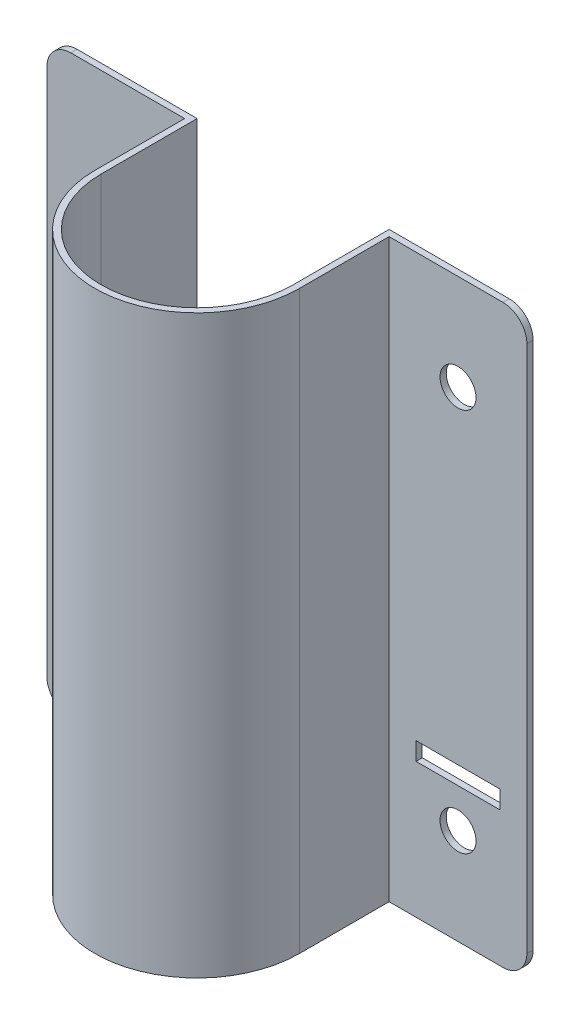
ISO-10303-21;
HEADER;
FILE_DESCRIPTION(('STEP AP214'),'2;1');
FILE_NAME('part.step','',(''),(''),'','','');
FILE_SCHEMA(('AUTOMOTIVE_DESIGN { 1 0 10303 214 1 1 1 1 }'));
ENDSEC;
DATA;
#1=APPLICATION_CONTEXT('core data for automotive mechanical design processes');
#2=APPLICATION_PROTOCOL_DEFINITION('international standard','automotive_design',2000,#1);
#3=PRODUCT_CONTEXT('',#1,'mechanical');
#4=PRODUCT('Part','Part','',(#3));
#5=PRODUCT_RELATED_PRODUCT_CATEGORY('part','',(#4));
#6=PRODUCT_DEFINITION_FORMATION('','',#4);
#7=PRODUCT_DEFINITION_CONTEXT('part definition',#1,'design');
#8=PRODUCT_DEFINITION('design','',#6,#7);
#9=PRODUCT_DEFINITION_SHAPE('','',#8);
#10=(LENGTH_UNIT() NAMED_UNIT(*) SI_UNIT(.MILLI.,.METRE.));
#11=(NAMED_UNIT(*) PLANE_ANGLE_UNIT() SI_UNIT($,.RADIAN.));
#12=(NAMED_UNIT(*) SI_UNIT($,.STERADIAN.) SOLID_ANGLE_UNIT());
#13=UNCERTAINTY_MEASURE_WITH_UNIT(LENGTH_MEASURE(1.E-05),#10,'distance_accuracy_value','');
#14=(GEOMETRIC_REPRESENTATION_CONTEXT(3) GLOBAL_UNCERTAINTY_ASSIGNED_CONTEXT((#13)) GLOBAL_UNIT_ASSIGNED_CONTEXT((#10,
#11,#12)) REPRESENTATION_CONTEXT('',''));
#15=CARTESIAN_POINT('',(0.,0.,0.));
#16=DIRECTION('',(0.,0.,1.));
#17=DIRECTION('',(1.,0.,0.));
#18=AXIS2_PLACEMENT_3D('',#15,#16,#17);
#19=CARTESIAN_POINT('',(0.,-152.4,0.));
#20=DIRECTION('',(0.,1.,0.));
#21=DIRECTION('',(0.,0.,1.));
#22=AXIS2_PLACEMENT_3D('',#19,#20,#21);
#23=CYLINDRICAL_SURFACE('',#22,25.4);
#24=CARTESIAN_POINT('',(0.,0.,0.));
#25=DIRECTION('',(0.,-1.,0.));
#26=DIRECTION('',(0.,0.,1.));
#27=AXIS2_PLACEMENT_3D('',#24,#25,#26);
#28=CIRCLE('',#27,25.4);
#29=CARTESIAN_POINT('',(25.4,0.,0.));
#30=VERTEX_POINT('',#29);
#31=CARTESIAN_POINT('',(-25.4,0.,0.));
#32=VERTEX_POINT('',#31);
#33=EDGE_CURVE('E284',#30,#32,#28,.T.);
#34=ORIENTED_EDGE('',*,*,#33,.F.);
#35=DIRECTION('',(0.,1.,0.));
#36=VECTOR('',#35,1.);
#37=CARTESIAN_POINT('',(25.4,-152.4,0.));
#38=LINE('',#37,#36);
#39=CARTESIAN_POINT('',(25.4,-152.4,0.));
#40=VERTEX_POINT('',#39);
#41=EDGE_CURVE('E341',#40,#30,#38,.T.);
#42=ORIENTED_EDGE('',*,*,#41,.F.);
#43=CARTESIAN_POINT('',(0.,-152.4,0.));
#44=DIRECTION('',(0.,-1.,0.));
#45=DIRECTION('',(0.,0.,1.));
#46=AXIS2_PLACEMENT_3D('',#43,#44,#45);
#47=CIRCLE('',#46,25.4);
#48=CARTESIAN_POINT('',(-25.4,-152.4,0.));
#49=VERTEX_POINT('',#48);
#50=EDGE_CURVE('E285',#40,#49,#47,.T.);
#51=ORIENTED_EDGE('',*,*,#50,.T.);
#52=DIRECTION('',(0.,1.,0.));
#53=VECTOR('',#52,1.);
#54=CARTESIAN_POINT('',(-25.4,-152.4,0.));
#55=LINE('',#54,#53);
#56=EDGE_CURVE('E314',#49,#32,#55,.T.);
#57=ORIENTED_EDGE('',*,*,#56,.T.);
#58=EDGE_LOOP('',(#34,#42,#51,#57));
#59=FACE_BOUND('',#58,.T.);
#60=ADVANCED_FACE('F36',(#59),#23,.F.);
#61=CARTESIAN_POINT('',(25.4,-152.4,0.));
#62=DIRECTION('',(-1.,0.,0.));
#63=DIRECTION('',(0.,0.,1.));
#64=AXIS2_PLACEMENT_3D('',#61,#62,#63);
#65=PLANE('',#64);
#66=DIRECTION('',(0.,0.,1.));
#67=VECTOR('',#66,1.);
#68=CARTESIAN_POINT('',(25.4,0.,0.));
#69=LINE('',#68,#67);
#70=CARTESIAN_POINT('',(25.4,0.,-25.4));
#71=VERTEX_POINT('',#70);
#72=EDGE_CURVE('E289',#71,#30,#69,.T.);
#73=ORIENTED_EDGE('',*,*,#72,.F.);
#74=DIRECTION('',(0.,1.,0.));
#75=VECTOR('',#74,1.);
#76=CARTESIAN_POINT('',(25.4,-152.4,-25.4));
#77=LINE('',#76,#75);
#78=CARTESIAN_POINT('',(25.4,-152.4,-25.4));
#79=VERTEX_POINT('',#78);
#80=EDGE_CURVE('E344',#79,#71,#77,.T.);
#81=ORIENTED_EDGE('',*,*,#80,.F.);
#82=DIRECTION('',(0.,0.,1.));
#83=VECTOR('',#82,1.);
#84=CARTESIAN_POINT('',(25.4,-152.4,0.));
#85=LINE('',#84,#83);
#86=EDGE_CURVE('E311',#79,#40,#85,.T.);
#87=ORIENTED_EDGE('',*,*,#86,.T.);
#88=ORIENTED_EDGE('',*,*,#41,.T.);
#89=EDGE_LOOP('',(#73,#81,#87,#88));
#90=FACE_BOUND('',#89,.T.);
#91=ADVANCED_FACE('F449',(#90),#65,.T.);
#92=CARTESIAN_POINT('',(25.4,-152.4,-25.4));
#93=DIRECTION('',(0.,0.,-1.));
#94=DIRECTION('',(-1.,0.,0.));
#95=AXIS2_PLACEMENT_3D('',#92,#93,#94);
#96=PLANE('',#95);
#97=DIRECTION('',(0.,-1.,0.));
#98=VECTOR('',#97,1.);
#99=CARTESIAN_POINT('',(34.163,-116.68125,-25.4));
#100=LINE('',#99,#98);
#101=CARTESIAN_POINT('',(34.163,-111.91875,-25.4));
#102=VERTEX_POINT('',#101);
#103=CARTESIAN_POINT('',(34.163,-116.68125,-25.4));
#104=VERTEX_POINT('',#103);
#105=EDGE_CURVE('E198',#102,#104,#100,.T.);
#106=ORIENTED_EDGE('',*,*,#105,.T.);
#107=DIRECTION('',(1.,0.,0.));
#108=VECTOR('',#107,1.);
#109=CARTESIAN_POINT('',(56.388,-116.68125,-25.4));
#110=LINE('',#109,#108);
#111=CARTESIAN_POINT('',(56.388,-116.68125,-25.4));
#112=VERTEX_POINT('',#111);
#113=EDGE_CURVE('E207',#104,#112,#110,.T.);
#114=ORIENTED_EDGE('',*,*,#113,.T.);
#115=DIRECTION('',(0.,1.,0.));
#116=VECTOR('',#115,1.);
#117=CARTESIAN_POINT('',(56.388,-116.68125,-25.4));
#118=LINE('',#117,#116);
#119=CARTESIAN_POINT('',(56.388,-111.91875,-25.4));
#120=VERTEX_POINT('',#119);
#121=EDGE_CURVE('E51',#112,#120,#118,.T.);
#122=ORIENTED_EDGE('',*,*,#121,.T.);
#123=DIRECTION('',(-1.,0.,0.));
#124=VECTOR('',#123,1.);
#125=CARTESIAN_POINT('',(56.388,-111.91875,-25.4));
#126=LINE('',#125,#124);
#127=EDGE_CURVE('E204',#120,#102,#126,.T.);
#128=ORIENTED_EDGE('',*,*,#127,.T.);
#129=EDGE_LOOP('',(#106,#114,#122,#128));
#130=FACE_BOUND('',#129,.T.);
#131=CARTESIAN_POINT('',(45.2755,-25.4,-25.4));
#132=DIRECTION('',(0.,0.,-1.));
#133=DIRECTION('',(-1.,0.,0.));
#134=AXIS2_PLACEMENT_3D('',#131,#132,#133);
#135=CIRCLE('',#134,4.76249999999999);
#136=CARTESIAN_POINT('',(40.513,-25.4,-25.4));
#137=VERTEX_POINT('',#136);
#138=EDGE_CURVE('E280',#137,#137,#135,.T.);
#139=ORIENTED_EDGE('',*,*,#138,.F.);
#140=EDGE_LOOP('',(#139));
#141=FACE_BOUND('',#140,.T.);
#142=CARTESIAN_POINT('',(45.2755,-127.,-25.4));
#143=DIRECTION('',(0.,0.,-1.));
#144=DIRECTION('',(-1.,0.,0.));
#145=AXIS2_PLACEMENT_3D('',#142,#143,#144);
#146=CIRCLE('',#145,4.76250000000002);
#147=CARTESIAN_POINT('',(40.513,-127.,-25.4));
#148=VERTEX_POINT('',#147);
#149=EDGE_CURVE('E277',#148,#148,#146,.T.);
#150=ORIENTED_EDGE('',*,*,#149,.F.);
#151=EDGE_LOOP('',(#150));
#152=FACE_BOUND('',#151,.T.);
#153=DIRECTION('',(-1.,0.,0.));
#154=VECTOR('',#153,1.);
#155=CARTESIAN_POINT('',(25.4,0.,-25.4));
#156=LINE('',#155,#154);
#157=CARTESIAN_POINT('',(57.15,0.,-25.4));
#158=VERTEX_POINT('',#157);
#159=EDGE_CURVE('E337',#158,#71,#156,.T.);
#160=ORIENTED_EDGE('',*,*,#159,.F.);
#161=CARTESIAN_POINT('',(57.15,-6.35,-25.4));
#162=DIRECTION('',(0.,0.,-1.));
#163=DIRECTION('',(-1.,0.,0.));
#164=AXIS2_PLACEMENT_3D('',#161,#162,#163);
#165=CIRCLE('',#164,6.35);
#166=CARTESIAN_POINT('',(63.5,-6.35000000000005,-25.4));
#167=VERTEX_POINT('',#166);
#168=EDGE_CURVE('E382',#158,#167,#165,.T.);
#169=ORIENTED_EDGE('',*,*,#168,.T.);
#170=DIRECTION('',(0.,1.,0.));
#171=VECTOR('',#170,1.);
#172=CARTESIAN_POINT('',(63.5,-152.4,-25.4));
#173=LINE('',#172,#171);
#174=CARTESIAN_POINT('',(63.5,-146.05,-25.4));
#175=VERTEX_POINT('',#174);
#176=EDGE_CURVE('E347',#175,#167,#173,.T.);
#177=ORIENTED_EDGE('',*,*,#176,.F.);
#178=CARTESIAN_POINT('',(57.15,-146.05,-25.4));
#179=DIRECTION('',(0.,0.,-1.));
#180=DIRECTION('',(-1.,0.,0.));
#181=AXIS2_PLACEMENT_3D('',#178,#179,#180);
#182=CIRCLE('',#181,6.35);
#183=CARTESIAN_POINT('',(57.15,-152.4,-25.4));
#184=VERTEX_POINT('',#183);
#185=EDGE_CURVE('E380',#175,#184,#182,.T.);
#186=ORIENTED_EDGE('',*,*,#185,.T.);
#187=DIRECTION('',(-1.,0.,0.));
#188=VECTOR('',#187,1.);
#189=CARTESIAN_POINT('',(25.4,-152.4,-25.4));
#190=LINE('',#189,#188);
#191=EDGE_CURVE('E309',#184,#79,#190,.T.);
#192=ORIENTED_EDGE('',*,*,#191,.T.);
#193=ORIENTED_EDGE('',*,*,#80,.T.);
#194=EDGE_LOOP('',(#160,#169,#177,#186,#192,#193));
#195=FACE_BOUND('',#194,.T.);
#196=ADVANCED_FACE('F211',(#130,#141,#152,#195),#96,.T.);
#197=CARTESIAN_POINT('',(63.5,-152.4,-25.4));
#198=DIRECTION('',(1.,0.,0.));
#199=DIRECTION('',(0.,0.,-1.));
#200=AXIS2_PLACEMENT_3D('',#197,#198,#199);
#201=PLANE('',#200);
#202=ORIENTED_EDGE('',*,*,#176,.T.);
#203=DIRECTION('',(0.,0.,-1.));
#204=VECTOR('',#203,1.);
#205=CARTESIAN_POINT('',(63.5,-6.34999999999999,-25.4));
#206=LINE('',#205,#204);
#207=CARTESIAN_POINT('',(63.5,-6.35000000000005,-23.749));
#208=VERTEX_POINT('',#207);
#209=EDGE_CURVE('E387',#167,#208,#206,.F.);
#210=ORIENTED_EDGE('',*,*,#209,.T.);
#211=DIRECTION('',(0.,1.,0.));
#212=VECTOR('',#211,1.);
#213=CARTESIAN_POINT('',(63.5,-152.4,-23.749));
#214=LINE('',#213,#212);
#215=CARTESIAN_POINT('',(63.5,-146.05,-23.749));
#216=VERTEX_POINT('',#215);
#217=EDGE_CURVE('E350',#216,#208,#214,.T.);
#218=ORIENTED_EDGE('',*,*,#217,.F.);
#219=DIRECTION('',(0.,0.,-1.));
#220=VECTOR('',#219,1.);
#221=CARTESIAN_POINT('',(63.5,-146.05,-25.4));
#222=LINE('',#221,#220);
#223=EDGE_CURVE('E384',#216,#175,#222,.T.);
#224=ORIENTED_EDGE('',*,*,#223,.T.);
#225=EDGE_LOOP('',(#202,#210,#218,#224));
#226=FACE_BOUND('',#225,.T.);
#227=ADVANCED_FACE('F463',(#226),#201,.T.);
#228=CARTESIAN_POINT('',(27.051,-152.4,-23.749));
#229=DIRECTION('',(0.,0.,1.));
#230=DIRECTION('',(1.,0.,0.));
#231=AXIS2_PLACEMENT_3D('',#228,#229,#230);
#232=PLANE('',#231);
#233=DIRECTION('',(0.,-1.,0.));
#234=VECTOR('',#233,1.);
#235=CARTESIAN_POINT('',(34.163,-116.68125,-23.749));
#236=LINE('',#235,#234);
#237=CARTESIAN_POINT('',(34.163,-111.91875,-23.749));
#238=VERTEX_POINT('',#237);
#239=CARTESIAN_POINT('',(34.163,-116.68125,-23.749));
#240=VERTEX_POINT('',#239);
#241=EDGE_CURVE('E59',#238,#240,#236,.T.);
#242=ORIENTED_EDGE('',*,*,#241,.F.);
#243=DIRECTION('',(-1.,0.,0.));
#244=VECTOR('',#243,1.);
#245=CARTESIAN_POINT('',(56.388,-111.91875,-23.749));
#246=LINE('',#245,#244);
#247=CARTESIAN_POINT('',(56.388,-111.91875,-23.749));
#248=VERTEX_POINT('',#247);
#249=EDGE_CURVE('E214',#248,#238,#246,.T.);
#250=ORIENTED_EDGE('',*,*,#249,.F.);
#251=DIRECTION('',(0.,1.,0.));
#252=VECTOR('',#251,1.);
#253=CARTESIAN_POINT('',(56.388,-116.68125,-23.749));
#254=LINE('',#253,#252);
#255=CARTESIAN_POINT('',(56.388,-116.68125,-23.749));
#256=VERTEX_POINT('',#255);
#257=EDGE_CURVE('E217',#256,#248,#254,.T.);
#258=ORIENTED_EDGE('',*,*,#257,.F.);
#259=DIRECTION('',(1.,0.,0.));
#260=VECTOR('',#259,1.);
#261=CARTESIAN_POINT('',(56.388,-116.68125,-23.749));
#262=LINE('',#261,#260);
#263=EDGE_CURVE('E223',#240,#256,#262,.T.);
#264=ORIENTED_EDGE('',*,*,#263,.F.);
#265=EDGE_LOOP('',(#242,#250,#258,#264));
#266=FACE_BOUND('',#265,.T.);
#267=CARTESIAN_POINT('',(45.2755,-25.4,-23.749));
#268=DIRECTION('',(0.,0.,1.));
#269=DIRECTION('',(-1.,0.,0.));
#270=AXIS2_PLACEMENT_3D('',#267,#268,#269);
#271=CIRCLE('',#270,4.76249999999999);
#272=CARTESIAN_POINT('',(40.513,-25.4,-23.749));
#273=VERTEX_POINT('',#272);
#274=EDGE_CURVE('E268',#273,#273,#271,.T.);
#275=ORIENTED_EDGE('',*,*,#274,.F.);
#276=EDGE_LOOP('',(#275));
#277=FACE_BOUND('',#276,.T.);
#278=CARTESIAN_POINT('',(45.2755,-127.,-23.749));
#279=DIRECTION('',(0.,0.,1.));
#280=DIRECTION('',(-1.,0.,0.));
#281=AXIS2_PLACEMENT_3D('',#278,#279,#280);
#282=CIRCLE('',#281,4.76250000000002);
#283=CARTESIAN_POINT('',(40.513,-127.,-23.749));
#284=VERTEX_POINT('',#283);
#285=EDGE_CURVE('E230',#284,#284,#282,.T.);
#286=ORIENTED_EDGE('',*,*,#285,.F.);
#287=EDGE_LOOP('',(#286));
#288=FACE_BOUND('',#287,.T.);
#289=ORIENTED_EDGE('',*,*,#217,.T.);
#290=CARTESIAN_POINT('',(57.15,-6.35,-23.749));
#291=DIRECTION('',(0.,0.,1.));
#292=DIRECTION('',(1.,0.,0.));
#293=AXIS2_PLACEMENT_3D('',#290,#291,#292);
#294=CIRCLE('',#293,6.35);
#295=CARTESIAN_POINT('',(57.15,0.,-23.749));
#296=VERTEX_POINT('',#295);
#297=EDGE_CURVE('E391',#208,#296,#294,.T.);
#298=ORIENTED_EDGE('',*,*,#297,.T.);
#299=DIRECTION('',(1.,0.,0.));
#300=VECTOR('',#299,1.);
#301=CARTESIAN_POINT('',(27.051,0.,-23.749));
#302=LINE('',#301,#300);
#303=CARTESIAN_POINT('',(27.051,0.,-23.749));
#304=VERTEX_POINT('',#303);
#305=EDGE_CURVE('E334',#304,#296,#302,.T.);
#306=ORIENTED_EDGE('',*,*,#305,.F.);
#307=DIRECTION('',(0.,1.,0.));
#308=VECTOR('',#307,1.);
#309=CARTESIAN_POINT('',(27.051,-152.4,-23.749));
#310=LINE('',#309,#308);
#311=CARTESIAN_POINT('',(27.051,-152.4,-23.749));
#312=VERTEX_POINT('',#311);
#313=EDGE_CURVE('E353',#312,#304,#310,.T.);
#314=ORIENTED_EDGE('',*,*,#313,.F.);
#315=DIRECTION('',(1.,0.,0.));
#316=VECTOR('',#315,1.);
#317=CARTESIAN_POINT('',(27.051,-152.4,-23.749));
#318=LINE('',#317,#316);
#319=CARTESIAN_POINT('',(57.15,-152.4,-23.749));
#320=VERTEX_POINT('',#319);
#321=EDGE_CURVE('E306',#312,#320,#318,.T.);
#322=ORIENTED_EDGE('',*,*,#321,.T.);
#323=CARTESIAN_POINT('',(57.15,-146.05,-23.749));
#324=DIRECTION('',(0.,0.,1.));
#325=DIRECTION('',(1.,0.,0.));
#326=AXIS2_PLACEMENT_3D('',#323,#324,#325);
#327=CIRCLE('',#326,6.35);
#328=EDGE_CURVE('E389',#320,#216,#327,.T.);
#329=ORIENTED_EDGE('',*,*,#328,.T.);
#330=EDGE_LOOP('',(#289,#298,#306,#314,#322,#329));
#331=FACE_BOUND('',#330,.T.);
#332=ADVANCED_FACE('F460',(#266,#277,#288,#331),#232,.T.);
#333=CARTESIAN_POINT('',(27.051,-152.4,0.));
#334=DIRECTION('',(1.,0.,0.));
#335=DIRECTION('',(0.,0.,-1.));
#336=AXIS2_PLACEMENT_3D('',#333,#334,#335);
#337=PLANE('',#336);
#338=DIRECTION('',(0.,0.,-1.));
#339=VECTOR('',#338,1.);
#340=CARTESIAN_POINT('',(27.051,0.,0.));
#341=LINE('',#340,#339);
#342=CARTESIAN_POINT('',(27.051,0.,0.));
#343=VERTEX_POINT('',#342);
#344=EDGE_CURVE('E331',#343,#304,#341,.T.);
#345=ORIENTED_EDGE('',*,*,#344,.F.);
#346=DIRECTION('',(0.,1.,0.));
#347=VECTOR('',#346,1.);
#348=CARTESIAN_POINT('',(27.051,-152.4,0.));
#349=LINE('',#348,#347);
#350=CARTESIAN_POINT('',(27.051,-152.4,0.));
#351=VERTEX_POINT('',#350);
#352=EDGE_CURVE('E355',#351,#343,#349,.T.);
#353=ORIENTED_EDGE('',*,*,#352,.F.);
#354=DIRECTION('',(0.,0.,-1.));
#355=VECTOR('',#354,1.);
#356=CARTESIAN_POINT('',(27.051,-152.4,0.));
#357=LINE('',#356,#355);
#358=EDGE_CURVE('E303',#351,#312,#357,.T.);
#359=ORIENTED_EDGE('',*,*,#358,.T.);
#360=ORIENTED_EDGE('',*,*,#313,.T.);
#361=EDGE_LOOP('',(#345,#353,#359,#360));
#362=FACE_BOUND('',#361,.T.);
#363=ADVANCED_FACE('F473',(#362),#337,.T.);
#364=CARTESIAN_POINT('',(0.,-152.4,0.));
#365=DIRECTION('',(0.,1.,0.));
#366=DIRECTION('',(0.,0.,1.));
#367=AXIS2_PLACEMENT_3D('',#364,#365,#366);
#368=CYLINDRICAL_SURFACE('',#367,27.051);
#369=CARTESIAN_POINT('',(0.,0.,0.));
#370=DIRECTION('',(0.,1.,0.));
#371=DIRECTION('',(0.,0.,1.));
#372=AXIS2_PLACEMENT_3D('',#369,#370,#371);
#373=CIRCLE('',#372,27.051);
#374=CARTESIAN_POINT('',(-27.051,0.,0.));
#375=VERTEX_POINT('',#374);
#376=EDGE_CURVE('E328',#375,#343,#373,.T.);
#377=ORIENTED_EDGE('',*,*,#376,.F.);
#378=DIRECTION('',(0.,1.,0.));
#379=VECTOR('',#378,1.);
#380=CARTESIAN_POINT('',(-27.051,-152.4,0.));
#381=LINE('',#380,#379);
#382=CARTESIAN_POINT('',(-27.051,-152.4,0.));
#383=VERTEX_POINT('',#382);
#384=EDGE_CURVE('E357',#383,#375,#381,.T.);
#385=ORIENTED_EDGE('',*,*,#384,.F.);
#386=CARTESIAN_POINT('',(0.,-152.4,0.));
#387=DIRECTION('',(0.,1.,0.));
#388=DIRECTION('',(0.,0.,1.));
#389=AXIS2_PLACEMENT_3D('',#386,#387,#388);
#390=CIRCLE('',#389,27.051);
#391=EDGE_CURVE('E300',#383,#351,#390,.T.);
#392=ORIENTED_EDGE('',*,*,#391,.T.);
#393=ORIENTED_EDGE('',*,*,#352,.T.);
#394=EDGE_LOOP('',(#377,#385,#392,#393));
#395=FACE_BOUND('',#394,.T.);
#396=ADVANCED_FACE('F475',(#395),#368,.T.);
#397=CARTESIAN_POINT('',(-27.051,-152.4,0.));
#398=DIRECTION('',(-1.,0.,0.));
#399=DIRECTION('',(0.,0.,1.));
#400=AXIS2_PLACEMENT_3D('',#397,#398,#399);
#401=PLANE('',#400);
#402=DIRECTION('',(0.,0.,1.));
#403=VECTOR('',#402,1.);
#404=CARTESIAN_POINT('',(-27.051,0.,0.));
#405=LINE('',#404,#403);
#406=CARTESIAN_POINT('',(-27.051,0.,-23.749));
#407=VERTEX_POINT('',#406);
#408=EDGE_CURVE('E325',#407,#375,#405,.T.);
#409=ORIENTED_EDGE('',*,*,#408,.F.);
#410=DIRECTION('',(0.,1.,0.));
#411=VECTOR('',#410,1.);
#412=CARTESIAN_POINT('',(-27.051,-152.4,-23.749));
#413=LINE('',#412,#411);
#414=CARTESIAN_POINT('',(-27.051,-152.4,-23.749));
#415=VERTEX_POINT('',#414);
#416=EDGE_CURVE('E359',#415,#407,#413,.T.);
#417=ORIENTED_EDGE('',*,*,#416,.F.);
#418=DIRECTION('',(0.,0.,1.));
#419=VECTOR('',#418,1.);
#420=CARTESIAN_POINT('',(-27.051,-152.4,0.));
#421=LINE('',#420,#419);
#422=EDGE_CURVE('E297',#415,#383,#421,.T.);
#423=ORIENTED_EDGE('',*,*,#422,.T.);
#424=ORIENTED_EDGE('',*,*,#384,.T.);
#425=EDGE_LOOP('',(#409,#417,#423,#424));
#426=FACE_BOUND('',#425,.T.);
#427=ADVANCED_FACE('F431',(#426),#401,.T.);
#428=CARTESIAN_POINT('',(-27.051,-152.4,-23.749));
#429=DIRECTION('',(0.,0.,1.));
#430=DIRECTION('',(1.,0.,0.));
#431=AXIS2_PLACEMENT_3D('',#428,#429,#430);
#432=PLANE('',#431);
#433=DIRECTION('',(0.,-1.,0.));
#434=VECTOR('',#433,1.);
#435=CARTESIAN_POINT('',(-56.388,-116.68125,-23.749));
#436=LINE('',#435,#434);
#437=CARTESIAN_POINT('',(-56.388,-111.91875,-23.749));
#438=VERTEX_POINT('',#437);
#439=CARTESIAN_POINT('',(-56.388,-116.68125,-23.749));
#440=VERTEX_POINT('',#439);
#441=EDGE_CURVE('E248',#438,#440,#436,.T.);
#442=ORIENTED_EDGE('',*,*,#441,.F.);
#443=DIRECTION('',(-1.,0.,0.));
#444=VECTOR('',#443,1.);
#445=CARTESIAN_POINT('',(-56.388,-111.91875,-23.749));
#446=LINE('',#445,#444);
#447=CARTESIAN_POINT('',(-34.163,-111.91875,-23.749));
#448=VERTEX_POINT('',#447);
#449=EDGE_CURVE('E238',#448,#438,#446,.T.);
#450=ORIENTED_EDGE('',*,*,#449,.F.);
#451=DIRECTION('',(0.,1.,0.));
#452=VECTOR('',#451,1.);
#453=CARTESIAN_POINT('',(-34.163,-116.68125,-23.749));
#454=LINE('',#453,#452);
#455=CARTESIAN_POINT('',(-34.163,-116.68125,-23.749));
#456=VERTEX_POINT('',#455);
#457=EDGE_CURVE('E253',#456,#448,#454,.T.);
#458=ORIENTED_EDGE('',*,*,#457,.F.);
#459=DIRECTION('',(1.,0.,0.));
#460=VECTOR('',#459,1.);
#461=CARTESIAN_POINT('',(-56.388,-116.68125,-23.749));
#462=LINE('',#461,#460);
#463=EDGE_CURVE('E250',#440,#456,#462,.T.);
#464=ORIENTED_EDGE('',*,*,#463,.F.);
#465=EDGE_LOOP('',(#442,#450,#458,#464));
#466=FACE_BOUND('',#465,.T.);
#467=CARTESIAN_POINT('',(-45.2755,-127.,-23.749));
#468=DIRECTION('',(0.,0.,1.));
#469=DIRECTION('',(1.,0.,0.));
#470=AXIS2_PLACEMENT_3D('',#467,#468,#469);
#471=CIRCLE('',#470,4.7625);
#472=CARTESIAN_POINT('',(-40.513,-127.,-23.749));
#473=VERTEX_POINT('',#472);
#474=EDGE_CURVE('E267',#473,#473,#471,.T.);
#475=ORIENTED_EDGE('',*,*,#474,.F.);
#476=EDGE_LOOP('',(#475));
#477=FACE_BOUND('',#476,.T.);
#478=CARTESIAN_POINT('',(-45.2755,-25.4,-23.749));
#479=DIRECTION('',(0.,0.,1.));
#480=DIRECTION('',(1.,0.,0.));
#481=AXIS2_PLACEMENT_3D('',#478,#479,#480);
#482=CIRCLE('',#481,4.7625);
#483=CARTESIAN_POINT('',(-40.513,-25.4,-23.749));
#484=VERTEX_POINT('',#483);
#485=EDGE_CURVE('E271',#484,#484,#482,.T.);
#486=ORIENTED_EDGE('',*,*,#485,.F.);
#487=EDGE_LOOP('',(#486));
#488=FACE_BOUND('',#487,.T.);
#489=DIRECTION('',(1.,0.,0.));
#490=VECTOR('',#489,1.);
#491=CARTESIAN_POINT('',(-27.051,0.,-23.749));
#492=LINE('',#491,#490);
#493=CARTESIAN_POINT('',(-57.15,0.,-23.749));
#494=VERTEX_POINT('',#493);
#495=EDGE_CURVE('E323',#494,#407,#492,.T.);
#496=ORIENTED_EDGE('',*,*,#495,.F.);
#497=CARTESIAN_POINT('',(-57.15,-6.35,-23.749));
#498=DIRECTION('',(0.,0.,1.));
#499=DIRECTION('',(1.,0.,0.));
#500=AXIS2_PLACEMENT_3D('',#497,#498,#499);
#501=CIRCLE('',#500,6.35);
#502=CARTESIAN_POINT('',(-63.5,-6.35000000000005,-23.749));
#503=VERTEX_POINT('',#502);
#504=EDGE_CURVE('E399',#494,#503,#501,.T.);
#505=ORIENTED_EDGE('',*,*,#504,.T.);
#506=DIRECTION('',(0.,1.,0.));
#507=VECTOR('',#506,1.);
#508=CARTESIAN_POINT('',(-63.5,-152.4,-23.749));
#509=LINE('',#508,#507);
#510=CARTESIAN_POINT('',(-63.5,-146.05,-23.749));
#511=VERTEX_POINT('',#510);
#512=EDGE_CURVE('E362',#511,#503,#509,.T.);
#513=ORIENTED_EDGE('',*,*,#512,.F.);
#514=CARTESIAN_POINT('',(-57.15,-146.05,-23.749));
#515=DIRECTION('',(0.,0.,1.));
#516=DIRECTION('',(1.,0.,0.));
#517=AXIS2_PLACEMENT_3D('',#514,#515,#516);
#518=CIRCLE('',#517,6.35);
#519=CARTESIAN_POINT('',(-57.15,-152.4,-23.749));
#520=VERTEX_POINT('',#519);
#521=EDGE_CURVE('E397',#511,#520,#518,.T.);
#522=ORIENTED_EDGE('',*,*,#521,.T.);
#523=DIRECTION('',(1.,0.,0.));
#524=VECTOR('',#523,1.);
#525=CARTESIAN_POINT('',(-27.051,-152.4,-23.749));
#526=LINE('',#525,#524);
#527=EDGE_CURVE('E295',#520,#415,#526,.T.);
#528=ORIENTED_EDGE('',*,*,#527,.T.);
#529=ORIENTED_EDGE('',*,*,#416,.T.);
#530=EDGE_LOOP('',(#496,#505,#513,#522,#528,#529));
#531=FACE_BOUND('',#530,.T.);
#532=ADVANCED_FACE('F421',(#466,#477,#488,#531),#432,.T.);
#533=CARTESIAN_POINT('',(-63.5,-152.4,-25.4));
#534=DIRECTION('',(-1.,0.,0.));
#535=DIRECTION('',(0.,0.,1.));
#536=AXIS2_PLACEMENT_3D('',#533,#534,#535);
#537=PLANE('',#536);
#538=ORIENTED_EDGE('',*,*,#512,.T.);
#539=DIRECTION('',(0.,0.,1.));
#540=VECTOR('',#539,1.);
#541=CARTESIAN_POINT('',(-63.5,-6.34999999999999,-25.4));
#542=LINE('',#541,#540);
#543=CARTESIAN_POINT('',(-63.5,-6.35000000000005,-25.4));
#544=VERTEX_POINT('',#543);
#545=EDGE_CURVE('E404',#503,#544,#542,.F.);
#546=ORIENTED_EDGE('',*,*,#545,.T.);
#547=DIRECTION('',(0.,1.,0.));
#548=VECTOR('',#547,1.);
#549=CARTESIAN_POINT('',(-63.5,-152.4,-25.4));
#550=LINE('',#549,#548);
#551=CARTESIAN_POINT('',(-63.5,-146.05,-25.4));
#552=VERTEX_POINT('',#551);
#553=EDGE_CURVE('E365',#552,#544,#550,.T.);
#554=ORIENTED_EDGE('',*,*,#553,.F.);
#555=DIRECTION('',(0.,0.,1.));
#556=VECTOR('',#555,1.);
#557=CARTESIAN_POINT('',(-63.5,-146.05,-23.749));
#558=LINE('',#557,#556);
#559=EDGE_CURVE('E401',#552,#511,#558,.T.);
#560=ORIENTED_EDGE('',*,*,#559,.T.);
#561=EDGE_LOOP('',(#538,#546,#554,#560));
#562=FACE_BOUND('',#561,.T.);
#563=ADVANCED_FACE('F415',(#562),#537,.T.);
#564=CARTESIAN_POINT('',(-25.4,-152.4,-25.4));
#565=DIRECTION('',(0.,0.,-1.));
#566=DIRECTION('',(-1.,0.,0.));
#567=AXIS2_PLACEMENT_3D('',#564,#565,#566);
#568=PLANE('',#567);
#569=DIRECTION('',(0.,-1.,0.));
#570=VECTOR('',#569,1.);
#571=CARTESIAN_POINT('',(-56.388,-116.68125,-25.4));
#572=LINE('',#571,#570);
#573=CARTESIAN_POINT('',(-56.388,-111.91875,-25.4));
#574=VERTEX_POINT('',#573);
#575=CARTESIAN_POINT('',(-56.388,-116.68125,-25.4));
#576=VERTEX_POINT('',#575);
#577=EDGE_CURVE('E234',#574,#576,#572,.T.);
#578=ORIENTED_EDGE('',*,*,#577,.T.);
#579=DIRECTION('',(1.,0.,0.));
#580=VECTOR('',#579,1.);
#581=CARTESIAN_POINT('',(-56.388,-116.68125,-25.4));
#582=LINE('',#581,#580);
#583=CARTESIAN_POINT('',(-34.163,-116.68125,-25.4));
#584=VERTEX_POINT('',#583);
#585=EDGE_CURVE('E237',#576,#584,#582,.T.);
#586=ORIENTED_EDGE('',*,*,#585,.T.);
#587=DIRECTION('',(0.,1.,0.));
#588=VECTOR('',#587,1.);
#589=CARTESIAN_POINT('',(-34.163,-116.68125,-25.4));
#590=LINE('',#589,#588);
#591=CARTESIAN_POINT('',(-34.163,-111.91875,-25.4));
#592=VERTEX_POINT('',#591);
#593=EDGE_CURVE('E241',#584,#592,#590,.T.);
#594=ORIENTED_EDGE('',*,*,#593,.T.);
#595=DIRECTION('',(-1.,0.,0.));
#596=VECTOR('',#595,1.);
#597=CARTESIAN_POINT('',(-56.388,-111.91875,-25.4));
#598=LINE('',#597,#596);
#599=EDGE_CURVE('E244',#592,#574,#598,.T.);
#600=ORIENTED_EDGE('',*,*,#599,.T.);
#601=EDGE_LOOP('',(#578,#586,#594,#600));
#602=FACE_BOUND('',#601,.T.);
#603=CARTESIAN_POINT('',(-45.2755,-127.,-25.4));
#604=DIRECTION('',(0.,0.,-1.));
#605=DIRECTION('',(-1.,0.,0.));
#606=AXIS2_PLACEMENT_3D('',#603,#604,#605);
#607=CIRCLE('',#606,4.7625);
#608=CARTESIAN_POINT('',(-50.038,-127.,-25.4));
#609=VERTEX_POINT('',#608);
#610=EDGE_CURVE('E281',#609,#609,#607,.T.);
#611=ORIENTED_EDGE('',*,*,#610,.F.);
#612=EDGE_LOOP('',(#611));
#613=FACE_BOUND('',#612,.T.);
#614=CARTESIAN_POINT('',(-45.2755,-25.4,-25.4));
#615=DIRECTION('',(0.,0.,-1.));
#616=DIRECTION('',(-1.,0.,0.));
#617=AXIS2_PLACEMENT_3D('',#614,#615,#616);
#618=CIRCLE('',#617,4.7625);
#619=CARTESIAN_POINT('',(-50.038,-25.4,-25.4));
#620=VERTEX_POINT('',#619);
#621=EDGE_CURVE('E276',#620,#620,#618,.T.);
#622=ORIENTED_EDGE('',*,*,#621,.F.);
#623=EDGE_LOOP('',(#622));
#624=FACE_BOUND('',#623,.T.);
#625=ORIENTED_EDGE('',*,*,#553,.T.);
#626=CARTESIAN_POINT('',(-57.15,-6.35,-25.4));
#627=DIRECTION('',(0.,0.,-1.));
#628=DIRECTION('',(-1.,0.,0.));
#629=AXIS2_PLACEMENT_3D('',#626,#627,#628);
#630=CIRCLE('',#629,6.35);
#631=CARTESIAN_POINT('',(-57.15,0.,-25.4));
#632=VERTEX_POINT('',#631);
#633=EDGE_CURVE('E11',#544,#632,#630,.T.);
#634=ORIENTED_EDGE('',*,*,#633,.T.);
#635=DIRECTION('',(-1.,0.,0.));
#636=VECTOR('',#635,1.);
#637=CARTESIAN_POINT('',(-25.4,0.,-25.4));
#638=LINE('',#637,#636);
#639=CARTESIAN_POINT('',(-25.4,0.,-25.4));
#640=VERTEX_POINT('',#639);
#641=EDGE_CURVE('E320',#640,#632,#638,.T.);
#642=ORIENTED_EDGE('',*,*,#641,.F.);
#643=DIRECTION('',(0.,1.,0.));
#644=VECTOR('',#643,1.);
#645=CARTESIAN_POINT('',(-25.4,-152.4,-25.4));
#646=LINE('',#645,#644);
#647=CARTESIAN_POINT('',(-25.4,-152.4,-25.4));
#648=VERTEX_POINT('',#647);
#649=EDGE_CURVE('E368',#648,#640,#646,.T.);
#650=ORIENTED_EDGE('',*,*,#649,.F.);
#651=DIRECTION('',(-1.,0.,0.));
#652=VECTOR('',#651,1.);
#653=CARTESIAN_POINT('',(-25.4,-152.4,-25.4));
#654=LINE('',#653,#652);
#655=CARTESIAN_POINT('',(-57.15,-152.4,-25.4));
#656=VERTEX_POINT('',#655);
#657=EDGE_CURVE('E292',#648,#656,#654,.T.);
#658=ORIENTED_EDGE('',*,*,#657,.T.);
#659=CARTESIAN_POINT('',(-57.15,-146.05,-25.4));
#660=DIRECTION('',(0.,0.,-1.));
#661=DIRECTION('',(-1.,0.,0.));
#662=AXIS2_PLACEMENT_3D('',#659,#660,#661);
#663=CIRCLE('',#662,6.35);
#664=EDGE_CURVE('E44',#656,#552,#663,.T.);
#665=ORIENTED_EDGE('',*,*,#664,.T.);
#666=EDGE_LOOP('',(#625,#634,#642,#650,#658,#665));
#667=FACE_BOUND('',#666,.T.);
#668=ADVANCED_FACE('F408',(#602,#613,#624,#667),#568,.T.);
#669=CARTESIAN_POINT('',(-25.4,-152.4,0.));
#670=DIRECTION('',(1.,0.,0.));
#671=DIRECTION('',(0.,0.,-1.));
#672=AXIS2_PLACEMENT_3D('',#669,#670,#671);
#673=PLANE('',#672);
#674=DIRECTION('',(0.,0.,-1.));
#675=VECTOR('',#674,1.);
#676=CARTESIAN_POINT('',(-25.4,0.,0.));
#677=LINE('',#676,#675);
#678=EDGE_CURVE('E317',#32,#640,#677,.T.);
#679=ORIENTED_EDGE('',*,*,#678,.F.);
#680=ORIENTED_EDGE('',*,*,#56,.F.);
#681=DIRECTION('',(0.,0.,-1.));
#682=VECTOR('',#681,1.);
#683=CARTESIAN_POINT('',(-25.4,-152.4,0.));
#684=LINE('',#683,#682);
#685=EDGE_CURVE('E288',#49,#648,#684,.T.);
#686=ORIENTED_EDGE('',*,*,#685,.T.);
#687=ORIENTED_EDGE('',*,*,#649,.T.);
#688=EDGE_LOOP('',(#679,#680,#686,#687));
#689=FACE_BOUND('',#688,.T.);
#690=ADVANCED_FACE('F442',(#689),#673,.T.);
#691=CARTESIAN_POINT('',(0.,-152.4,0.));
#692=DIRECTION('',(0.,1.,0.));
#693=DIRECTION('',(0.,0.,1.));
#694=AXIS2_PLACEMENT_3D('',#691,#692,#693);
#695=PLANE('',#694);
#696=ORIENTED_EDGE('',*,*,#191,.F.);
#697=DIRECTION('',(0.,0.,-1.));
#698=VECTOR('',#697,1.);
#699=CARTESIAN_POINT('',(57.15,-152.4,-23.749));
#700=LINE('',#699,#698);
#701=EDGE_CURVE('E395',#184,#320,#700,.F.);
#702=ORIENTED_EDGE('',*,*,#701,.T.);
#703=ORIENTED_EDGE('',*,*,#321,.F.);
#704=ORIENTED_EDGE('',*,*,#358,.F.);
#705=ORIENTED_EDGE('',*,*,#391,.F.);
#706=ORIENTED_EDGE('',*,*,#422,.F.);
#707=ORIENTED_EDGE('',*,*,#527,.F.);
#708=DIRECTION('',(0.,0.,1.));
#709=VECTOR('',#708,1.);
#710=CARTESIAN_POINT('',(-57.15,-152.4,-25.4));
#711=LINE('',#710,#709);
#712=EDGE_CURVE('E393',#520,#656,#711,.F.);
#713=ORIENTED_EDGE('',*,*,#712,.T.);
#714=ORIENTED_EDGE('',*,*,#657,.F.);
#715=ORIENTED_EDGE('',*,*,#685,.F.);
#716=ORIENTED_EDGE('',*,*,#50,.F.);
#717=ORIENTED_EDGE('',*,*,#86,.F.);
#718=EDGE_LOOP('',(#696,#702,#703,#704,#705,#706,#707,#713,#714,#715,#716,#717));
#719=FACE_BOUND('',#718,.T.);
#720=ADVANCED_FACE('F426',(#719),#695,.F.);
#721=CARTESIAN_POINT('',(0.,0.,0.));
#722=DIRECTION('',(0.,1.,0.));
#723=DIRECTION('',(0.,0.,1.));
#724=AXIS2_PLACEMENT_3D('',#721,#722,#723);
#725=PLANE('',#724);
#726=ORIENTED_EDGE('',*,*,#305,.T.);
#727=DIRECTION('',(0.,0.,-1.));
#728=VECTOR('',#727,1.);
#729=CARTESIAN_POINT('',(57.15,0.,0.));
#730=LINE('',#729,#728);
#731=EDGE_CURVE('E377',#296,#158,#730,.T.);
#732=ORIENTED_EDGE('',*,*,#731,.T.);
#733=ORIENTED_EDGE('',*,*,#159,.T.);
#734=ORIENTED_EDGE('',*,*,#72,.T.);
#735=ORIENTED_EDGE('',*,*,#33,.T.);
#736=ORIENTED_EDGE('',*,*,#678,.T.);
#737=ORIENTED_EDGE('',*,*,#641,.T.);
#738=DIRECTION('',(0.,0.,1.));
#739=VECTOR('',#738,1.);
#740=CARTESIAN_POINT('',(-57.15,0.,0.));
#741=LINE('',#740,#739);
#742=EDGE_CURVE('E343',#632,#494,#741,.T.);
#743=ORIENTED_EDGE('',*,*,#742,.T.);
#744=ORIENTED_EDGE('',*,*,#495,.T.);
#745=ORIENTED_EDGE('',*,*,#408,.T.);
#746=ORIENTED_EDGE('',*,*,#376,.T.);
#747=ORIENTED_EDGE('',*,*,#344,.T.);
#748=EDGE_LOOP('',(#726,#732,#733,#734,#735,#736,#737,#743,#744,#745,#746,#747));
#749=FACE_BOUND('',#748,.T.);
#750=ADVANCED_FACE('F434',(#749),#725,.T.);
#751=CARTESIAN_POINT('',(-45.2755,-25.4,-74.549));
#752=DIRECTION('',(0.,0.,1.));
#753=DIRECTION('',(1.,0.,0.));
#754=AXIS2_PLACEMENT_3D('',#751,#752,#753);
#755=CYLINDRICAL_SURFACE('',#754,4.7625);
#756=ORIENTED_EDGE('',*,*,#621,.T.);
#757=EDGE_LOOP('',(#756));
#758=FACE_BOUND('',#757,.T.);
#759=ORIENTED_EDGE('',*,*,#485,.T.);
#760=EDGE_LOOP('',(#759));
#761=FACE_BOUND('',#760,.T.);
#762=ADVANCED_FACE('F528',(#758,#761),#755,.F.);
#763=CARTESIAN_POINT('',(-45.2755,-127.,-74.549));
#764=DIRECTION('',(0.,0.,1.));
#765=DIRECTION('',(1.,0.,0.));
#766=AXIS2_PLACEMENT_3D('',#763,#764,#765);
#767=CYLINDRICAL_SURFACE('',#766,4.7625);
#768=ORIENTED_EDGE('',*,*,#610,.T.);
#769=EDGE_LOOP('',(#768));
#770=FACE_BOUND('',#769,.T.);
#771=ORIENTED_EDGE('',*,*,#474,.T.);
#772=EDGE_LOOP('',(#771));
#773=FACE_BOUND('',#772,.T.);
#774=ADVANCED_FACE('F521',(#770,#773),#767,.F.);
#775=CARTESIAN_POINT('',(45.2755,-127.,-74.549));
#776=DIRECTION('',(0.,0.,1.));
#777=DIRECTION('',(1.,0.,0.));
#778=AXIS2_PLACEMENT_3D('',#775,#776,#777);
#779=CYLINDRICAL_SURFACE('',#778,4.76250000000002);
#780=ORIENTED_EDGE('',*,*,#149,.T.);
#781=EDGE_LOOP('',(#780));
#782=FACE_BOUND('',#781,.T.);
#783=ORIENTED_EDGE('',*,*,#285,.T.);
#784=EDGE_LOOP('',(#783));
#785=FACE_BOUND('',#784,.T.);
#786=ADVANCED_FACE('F518',(#782,#785),#779,.F.);
#787=CARTESIAN_POINT('',(45.2755,-25.4,-74.549));
#788=DIRECTION('',(0.,0.,1.));
#789=DIRECTION('',(1.,0.,0.));
#790=AXIS2_PLACEMENT_3D('',#787,#788,#789);
#791=CYLINDRICAL_SURFACE('',#790,4.76249999999999);
#792=ORIENTED_EDGE('',*,*,#138,.T.);
#793=EDGE_LOOP('',(#792));
#794=FACE_BOUND('',#793,.T.);
#795=ORIENTED_EDGE('',*,*,#274,.T.);
#796=EDGE_LOOP('',(#795));
#797=FACE_BOUND('',#796,.T.);
#798=ADVANCED_FACE('F495',(#794,#797),#791,.F.);
#799=CARTESIAN_POINT('',(57.15,-6.35,0.));
#800=DIRECTION('',(0.,0.,-1.));
#801=DIRECTION('',(-1.,0.,0.));
#802=AXIS2_PLACEMENT_3D('',#799,#800,#801);
#803=CYLINDRICAL_SURFACE('',#802,6.35);
#804=ORIENTED_EDGE('',*,*,#297,.F.);
#805=ORIENTED_EDGE('',*,*,#209,.F.);
#806=ORIENTED_EDGE('',*,*,#168,.F.);
#807=ORIENTED_EDGE('',*,*,#731,.F.);
#808=EDGE_LOOP('',(#804,#805,#806,#807));
#809=FACE_BOUND('',#808,.T.);
#810=ADVANCED_FACE('F467',(#809),#803,.T.);
#811=CARTESIAN_POINT('',(57.15,-146.05,-25.4));
#812=DIRECTION('',(0.,0.,1.));
#813=DIRECTION('',(1.,0.,0.));
#814=AXIS2_PLACEMENT_3D('',#811,#812,#813);
#815=CYLINDRICAL_SURFACE('',#814,6.35);
#816=ORIENTED_EDGE('',*,*,#328,.F.);
#817=ORIENTED_EDGE('',*,*,#701,.F.);
#818=ORIENTED_EDGE('',*,*,#185,.F.);
#819=ORIENTED_EDGE('',*,*,#223,.F.);
#820=EDGE_LOOP('',(#816,#817,#818,#819));
#821=FACE_BOUND('',#820,.T.);
#822=ADVANCED_FACE('F456',(#821),#815,.T.);
#823=CARTESIAN_POINT('',(-57.15,-6.35,0.));
#824=DIRECTION('',(0.,0.,1.));
#825=DIRECTION('',(1.,0.,0.));
#826=AXIS2_PLACEMENT_3D('',#823,#824,#825);
#827=CYLINDRICAL_SURFACE('',#826,6.35);
#828=ORIENTED_EDGE('',*,*,#633,.F.);
#829=ORIENTED_EDGE('',*,*,#545,.F.);
#830=ORIENTED_EDGE('',*,*,#504,.F.);
#831=ORIENTED_EDGE('',*,*,#742,.F.);
#832=EDGE_LOOP('',(#828,#829,#830,#831));
#833=FACE_BOUND('',#832,.T.);
#834=ADVANCED_FACE('F438',(#833),#827,.T.);
#835=CARTESIAN_POINT('',(-57.15,-146.05,-25.4));
#836=DIRECTION('',(0.,0.,-1.));
#837=DIRECTION('',(-1.,0.,0.));
#838=AXIS2_PLACEMENT_3D('',#835,#836,#837);
#839=CYLINDRICAL_SURFACE('',#838,6.35);
#840=ORIENTED_EDGE('',*,*,#664,.F.);
#841=ORIENTED_EDGE('',*,*,#712,.F.);
#842=ORIENTED_EDGE('',*,*,#521,.F.);
#843=ORIENTED_EDGE('',*,*,#559,.F.);
#844=EDGE_LOOP('',(#840,#841,#842,#843));
#845=FACE_BOUND('',#844,.T.);
#846=ADVANCED_FACE('F38',(#845),#839,.T.);
#847=CARTESIAN_POINT('',(-56.388,-116.68125,-25.4));
#848=DIRECTION('',(-1.,0.,0.));
#849=DIRECTION('',(0.,0.,1.));
#850=AXIS2_PLACEMENT_3D('',#847,#848,#849);
#851=PLANE('',#850);
#852=ORIENTED_EDGE('',*,*,#441,.T.);
#853=DIRECTION('',(0.,0.,1.));
#854=VECTOR('',#853,1.);
#855=CARTESIAN_POINT('',(-56.388,-116.68125,-25.4));
#856=LINE('',#855,#854);
#857=EDGE_CURVE('E247',#576,#440,#856,.T.);
#858=ORIENTED_EDGE('',*,*,#857,.F.);
#859=ORIENTED_EDGE('',*,*,#577,.F.);
#860=DIRECTION('',(0.,0.,1.));
#861=VECTOR('',#860,1.);
#862=CARTESIAN_POINT('',(-56.388,-111.91875,-25.4));
#863=LINE('',#862,#861);
#864=EDGE_CURVE('E224',#574,#438,#863,.T.);
#865=ORIENTED_EDGE('',*,*,#864,.T.);
#866=EDGE_LOOP('',(#852,#858,#859,#865));
#867=FACE_BOUND('',#866,.T.);
#868=ADVANCED_FACE('F501',(#867),#851,.F.);
#869=CARTESIAN_POINT('',(-56.388,-111.91875,-25.4));
#870=DIRECTION('',(0.,1.,0.));
#871=DIRECTION('',(0.,0.,1.));
#872=AXIS2_PLACEMENT_3D('',#869,#870,#871);
#873=PLANE('',#872);
#874=ORIENTED_EDGE('',*,*,#449,.T.);
#875=ORIENTED_EDGE('',*,*,#864,.F.);
#876=ORIENTED_EDGE('',*,*,#599,.F.);
#877=DIRECTION('',(0.,0.,1.));
#878=VECTOR('',#877,1.);
#879=CARTESIAN_POINT('',(-34.163,-111.91875,-25.4));
#880=LINE('',#879,#878);
#881=EDGE_CURVE('E259',#592,#448,#880,.T.);
#882=ORIENTED_EDGE('',*,*,#881,.T.);
#883=EDGE_LOOP('',(#874,#875,#876,#882));
#884=FACE_BOUND('',#883,.T.);
#885=ADVANCED_FACE('F505',(#884),#873,.F.);
#886=CARTESIAN_POINT('',(-34.163,-116.68125,-25.4));
#887=DIRECTION('',(1.,0.,0.));
#888=DIRECTION('',(0.,0.,-1.));
#889=AXIS2_PLACEMENT_3D('',#886,#887,#888);
#890=PLANE('',#889);
#891=ORIENTED_EDGE('',*,*,#457,.T.);
#892=ORIENTED_EDGE('',*,*,#881,.F.);
#893=ORIENTED_EDGE('',*,*,#593,.F.);
#894=DIRECTION('',(0.,0.,1.));
#895=VECTOR('',#894,1.);
#896=CARTESIAN_POINT('',(-34.163,-116.68125,-25.4));
#897=LINE('',#896,#895);
#898=EDGE_CURVE('E261',#584,#456,#897,.T.);
#899=ORIENTED_EDGE('',*,*,#898,.T.);
#900=EDGE_LOOP('',(#891,#892,#893,#899));
#901=FACE_BOUND('',#900,.T.);
#902=ADVANCED_FACE('F511',(#901),#890,.F.);
#903=CARTESIAN_POINT('',(-56.388,-116.68125,-25.4));
#904=DIRECTION('',(0.,-1.,0.));
#905=DIRECTION('',(0.,0.,-1.));
#906=AXIS2_PLACEMENT_3D('',#903,#904,#905);
#907=PLANE('',#906);
#908=ORIENTED_EDGE('',*,*,#463,.T.);
#909=ORIENTED_EDGE('',*,*,#898,.F.);
#910=ORIENTED_EDGE('',*,*,#585,.F.);
#911=ORIENTED_EDGE('',*,*,#857,.T.);
#912=EDGE_LOOP('',(#908,#909,#910,#911));
#913=FACE_BOUND('',#912,.T.);
#914=ADVANCED_FACE('F516',(#913),#907,.F.);
#915=CARTESIAN_POINT('',(34.163,-116.68125,-25.4));
#916=DIRECTION('',(-1.,0.,0.));
#917=DIRECTION('',(0.,0.,1.));
#918=AXIS2_PLACEMENT_3D('',#915,#916,#917);
#919=PLANE('',#918);
#920=ORIENTED_EDGE('',*,*,#241,.T.);
#921=DIRECTION('',(0.,0.,1.));
#922=VECTOR('',#921,1.);
#923=CARTESIAN_POINT('',(34.163,-116.68125,-25.4));
#924=LINE('',#923,#922);
#925=EDGE_CURVE('E194',#104,#240,#924,.T.);
#926=ORIENTED_EDGE('',*,*,#925,.F.);
#927=ORIENTED_EDGE('',*,*,#105,.F.);
#928=DIRECTION('',(0.,0.,1.));
#929=VECTOR('',#928,1.);
#930=CARTESIAN_POINT('',(34.163,-111.91875,-25.4));
#931=LINE('',#930,#929);
#932=EDGE_CURVE('E228',#102,#238,#931,.T.);
#933=ORIENTED_EDGE('',*,*,#932,.T.);
#934=EDGE_LOOP('',(#920,#926,#927,#933));
#935=FACE_BOUND('',#934,.T.);
#936=ADVANCED_FACE('F196',(#935),#919,.F.);
#937=CARTESIAN_POINT('',(56.388,-111.91875,-25.4));
#938=DIRECTION('',(0.,1.,0.));
#939=DIRECTION('',(0.,0.,1.));
#940=AXIS2_PLACEMENT_3D('',#937,#938,#939);
#941=PLANE('',#940);
#942=ORIENTED_EDGE('',*,*,#249,.T.);
#943=ORIENTED_EDGE('',*,*,#932,.F.);
#944=ORIENTED_EDGE('',*,*,#127,.F.);
#945=DIRECTION('',(0.,0.,1.));
#946=VECTOR('',#945,1.);
#947=CARTESIAN_POINT('',(56.388,-111.91875,-25.4));
#948=LINE('',#947,#946);
#949=EDGE_CURVE('E231',#120,#248,#948,.T.);
#950=ORIENTED_EDGE('',*,*,#949,.T.);
#951=EDGE_LOOP('',(#942,#943,#944,#950));
#952=FACE_BOUND('',#951,.T.);
#953=ADVANCED_FACE('F555',(#952),#941,.F.);
#954=CARTESIAN_POINT('',(56.388,-116.68125,-25.4));
#955=DIRECTION('',(1.,0.,0.));
#956=DIRECTION('',(0.,0.,-1.));
#957=AXIS2_PLACEMENT_3D('',#954,#955,#956);
#958=PLANE('',#957);
#959=ORIENTED_EDGE('',*,*,#257,.T.);
#960=ORIENTED_EDGE('',*,*,#949,.F.);
#961=ORIENTED_EDGE('',*,*,#121,.F.);
#962=DIRECTION('',(0.,0.,1.));
#963=VECTOR('',#962,1.);
#964=CARTESIAN_POINT('',(56.388,-116.68125,-25.4));
#965=LINE('',#964,#963);
#966=EDGE_CURVE('E203',#112,#256,#965,.T.);
#967=ORIENTED_EDGE('',*,*,#966,.T.);
#968=EDGE_LOOP('',(#959,#960,#961,#967));
#969=FACE_BOUND('',#968,.T.);
#970=ADVANCED_FACE('F553',(#969),#958,.F.);
#971=CARTESIAN_POINT('',(56.388,-116.68125,-25.4));
#972=DIRECTION('',(0.,-1.,0.));
#973=DIRECTION('',(0.,0.,-1.));
#974=AXIS2_PLACEMENT_3D('',#971,#972,#973);
#975=PLANE('',#974);
#976=ORIENTED_EDGE('',*,*,#263,.T.);
#977=ORIENTED_EDGE('',*,*,#966,.F.);
#978=ORIENTED_EDGE('',*,*,#113,.F.);
#979=ORIENTED_EDGE('',*,*,#925,.T.);
#980=EDGE_LOOP('',(#976,#977,#978,#979));
#981=FACE_BOUND('',#980,.T.);
#982=ADVANCED_FACE('F208',(#981),#975,.F.);
#983=CLOSED_SHELL('',(#60,#91,#196,#227,#332,#363,#396,#427,#532,#563,#668,#690,#720,#750,#762,
#774,#786,#798,#810,#822,#834,#846,#868,#885,#902,#914,#936,#953,#970,#982));
#984=MANIFOLD_SOLID_BREP('B2',#983);
#985=ADVANCED_BREP_SHAPE_REPRESENTATION('',(#18,#984),#14);
#986=SHAPE_DEFINITION_REPRESENTATION(#9,#985);
ENDSEC;
END-ISO-10303-21;
